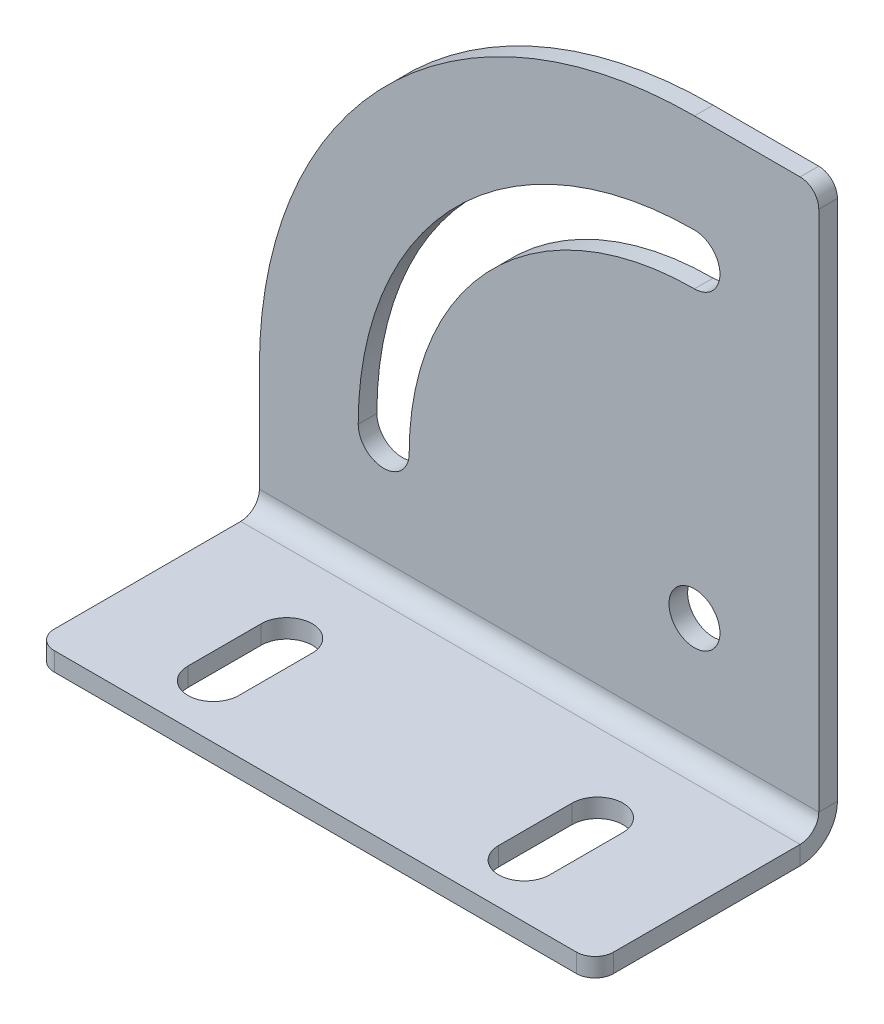
ISO-10303-21;
HEADER;
FILE_DESCRIPTION(('STEP AP214'),'2;1');
FILE_NAME('part.step','',(''),(''),'','','');
FILE_SCHEMA(('AUTOMOTIVE_DESIGN { 1 0 10303 214 1 1 1 1 }'));
ENDSEC;
DATA;
#1=APPLICATION_CONTEXT('core data for automotive mechanical design processes');
#2=APPLICATION_PROTOCOL_DEFINITION('international standard','automotive_design',2000,#1);
#3=PRODUCT_CONTEXT('',#1,'mechanical');
#4=PRODUCT('Part','Part','',(#3));
#5=PRODUCT_RELATED_PRODUCT_CATEGORY('part','',(#4));
#6=PRODUCT_DEFINITION_FORMATION('','',#4);
#7=PRODUCT_DEFINITION_CONTEXT('part definition',#1,'design');
#8=PRODUCT_DEFINITION('design','',#6,#7);
#9=PRODUCT_DEFINITION_SHAPE('','',#8);
#10=(LENGTH_UNIT() NAMED_UNIT(*) SI_UNIT(.MILLI.,.METRE.));
#11=(NAMED_UNIT(*) PLANE_ANGLE_UNIT() SI_UNIT($,.RADIAN.));
#12=(NAMED_UNIT(*) SI_UNIT($,.STERADIAN.) SOLID_ANGLE_UNIT());
#13=UNCERTAINTY_MEASURE_WITH_UNIT(LENGTH_MEASURE(1.E-05),#10,'distance_accuracy_value','');
#14=(GEOMETRIC_REPRESENTATION_CONTEXT(3) GLOBAL_UNCERTAINTY_ASSIGNED_CONTEXT((#13)) GLOBAL_UNIT_ASSIGNED_CONTEXT((#10,
#11,#12)) REPRESENTATION_CONTEXT('',''));
#15=CARTESIAN_POINT('',(0.,0.,0.));
#16=DIRECTION('',(0.,0.,1.));
#17=DIRECTION('',(1.,0.,0.));
#18=AXIS2_PLACEMENT_3D('',#15,#16,#17);
#19=CARTESIAN_POINT('',(-50.,0.,3.));
#20=DIRECTION('',(0.,0.,-1.));
#21=DIRECTION('',(-1.,0.,0.));
#22=AXIS2_PLACEMENT_3D('',#19,#20,#21);
#23=CYLINDRICAL_SURFACE('',#22,4.1);
#24=DIRECTION('',(0.,0.,1.));
#25=VECTOR('',#24,1.);
#26=CARTESIAN_POINT('',(-45.9,0.,3.));
#27=LINE('',#26,#25);
#28=CARTESIAN_POINT('',(-45.9,0.,0.));
#29=VERTEX_POINT('',#28);
#30=CARTESIAN_POINT('',(-45.9,0.,3.));
#31=VERTEX_POINT('',#30);
#32=EDGE_CURVE('E376',#29,#31,#27,.T.);
#33=ORIENTED_EDGE('',*,*,#32,.F.);
#34=CARTESIAN_POINT('',(-50.,0.,0.));
#35=DIRECTION('',(0.,0.,1.));
#36=DIRECTION('',(1.,0.,0.));
#37=AXIS2_PLACEMENT_3D('',#34,#35,#36);
#38=CIRCLE('',#37,4.1);
#39=CARTESIAN_POINT('',(-54.1,0.,0.));
#40=VERTEX_POINT('',#39);
#41=EDGE_CURVE('E333',#40,#29,#38,.T.);
#42=ORIENTED_EDGE('',*,*,#41,.F.);
#43=DIRECTION('',(0.,0.,1.));
#44=VECTOR('',#43,1.);
#45=CARTESIAN_POINT('',(-54.1,0.,3.));
#46=LINE('',#45,#44);
#47=CARTESIAN_POINT('',(-54.1,0.,3.));
#48=VERTEX_POINT('',#47);
#49=EDGE_CURVE('E374',#40,#48,#46,.T.);
#50=ORIENTED_EDGE('',*,*,#49,.T.);
#51=CARTESIAN_POINT('',(-50.,0.,3.));
#52=DIRECTION('',(0.,0.,1.));
#53=DIRECTION('',(1.,0.,0.));
#54=AXIS2_PLACEMENT_3D('',#51,#52,#53);
#55=CIRCLE('',#54,4.1);
#56=EDGE_CURVE('E203',#48,#31,#55,.T.);
#57=ORIENTED_EDGE('',*,*,#56,.T.);
#58=EDGE_LOOP('',(#33,#42,#50,#57));
#59=FACE_BOUND('',#58,.T.);
#60=ADVANCED_FACE('F16',(#59),#23,.F.);
#61=CARTESIAN_POINT('',(0.,0.,3.));
#62=DIRECTION('',(0.,0.,-1.));
#63=DIRECTION('',(-1.,0.,0.));
#64=AXIS2_PLACEMENT_3D('',#61,#62,#63);
#65=CYLINDRICAL_SURFACE('',#64,54.1);
#66=ORIENTED_EDGE('',*,*,#49,.F.);
#67=CARTESIAN_POINT('',(0.,0.,0.));
#68=DIRECTION('',(0.,0.,1.));
#69=DIRECTION('',(1.,0.,0.));
#70=AXIS2_PLACEMENT_3D('',#67,#68,#69);
#71=CIRCLE('',#70,54.1);
#72=CARTESIAN_POINT('',(0.,54.1,0.));
#73=VERTEX_POINT('',#72);
#74=EDGE_CURVE('E330',#73,#40,#71,.T.);
#75=ORIENTED_EDGE('',*,*,#74,.F.);
#76=DIRECTION('',(0.,0.,1.));
#77=VECTOR('',#76,1.);
#78=CARTESIAN_POINT('',(0.,54.1,3.));
#79=LINE('',#78,#77);
#80=CARTESIAN_POINT('',(0.,54.1,3.));
#81=VERTEX_POINT('',#80);
#82=EDGE_CURVE('E372',#73,#81,#79,.T.);
#83=ORIENTED_EDGE('',*,*,#82,.T.);
#84=CARTESIAN_POINT('',(0.,0.,3.));
#85=DIRECTION('',(0.,0.,1.));
#86=DIRECTION('',(1.,0.,0.));
#87=AXIS2_PLACEMENT_3D('',#84,#85,#86);
#88=CIRCLE('',#87,54.1);
#89=EDGE_CURVE('E206',#81,#48,#88,.T.);
#90=ORIENTED_EDGE('',*,*,#89,.T.);
#91=EDGE_LOOP('',(#66,#75,#83,#90));
#92=FACE_BOUND('',#91,.T.);
#93=ADVANCED_FACE('F432',(#92),#65,.F.);
#94=CARTESIAN_POINT('',(0.,50.,3.));
#95=DIRECTION('',(0.,0.,-1.));
#96=DIRECTION('',(-1.,0.,0.));
#97=AXIS2_PLACEMENT_3D('',#94,#95,#96);
#98=CYLINDRICAL_SURFACE('',#97,4.1);
#99=ORIENTED_EDGE('',*,*,#82,.F.);
#100=CARTESIAN_POINT('',(0.,50.,0.));
#101=DIRECTION('',(0.,0.,1.));
#102=DIRECTION('',(1.,0.,0.));
#103=AXIS2_PLACEMENT_3D('',#100,#101,#102);
#104=CIRCLE('',#103,4.1);
#105=CARTESIAN_POINT('',(0.,45.9,0.));
#106=VERTEX_POINT('',#105);
#107=EDGE_CURVE('E321',#106,#73,#104,.T.);
#108=ORIENTED_EDGE('',*,*,#107,.F.);
#109=DIRECTION('',(0.,0.,1.));
#110=VECTOR('',#109,1.);
#111=CARTESIAN_POINT('',(0.,45.9,3.));
#112=LINE('',#111,#110);
#113=CARTESIAN_POINT('',(0.,45.9,3.));
#114=VERTEX_POINT('',#113);
#115=EDGE_CURVE('E370',#106,#114,#112,.T.);
#116=ORIENTED_EDGE('',*,*,#115,.T.);
#117=CARTESIAN_POINT('',(0.,50.,3.));
#118=DIRECTION('',(0.,0.,1.));
#119=DIRECTION('',(1.,0.,0.));
#120=AXIS2_PLACEMENT_3D('',#117,#118,#119);
#121=CIRCLE('',#120,4.1);
#122=EDGE_CURVE('E194',#114,#81,#121,.T.);
#123=ORIENTED_EDGE('',*,*,#122,.T.);
#124=EDGE_LOOP('',(#99,#108,#116,#123));
#125=FACE_BOUND('',#124,.T.);
#126=ADVANCED_FACE('F438',(#125),#98,.F.);
#127=CARTESIAN_POINT('',(20.,-20.,3.));
#128=DIRECTION('',(-1.,0.,0.));
#129=DIRECTION('',(0.,1.,0.));
#130=AXIS2_PLACEMENT_3D('',#127,#128,#129);
#131=PLANE('',#130);
#132=DIRECTION('',(0.,1.,0.));
#133=VECTOR('',#132,1.);
#134=CARTESIAN_POINT('',(20.,0.,0.));
#135=LINE('',#134,#133);
#136=CARTESIAN_POINT('',(20.,-17.,0.));
#137=VERTEX_POINT('',#136);
#138=CARTESIAN_POINT('',(20.,67.,0.));
#139=VERTEX_POINT('',#138);
#140=EDGE_CURVE('E318',#137,#139,#135,.T.);
#141=ORIENTED_EDGE('',*,*,#140,.T.);
#142=DIRECTION('',(0.,0.,-1.));
#143=VECTOR('',#142,1.);
#144=CARTESIAN_POINT('',(20.,67.,3.));
#145=LINE('',#144,#143);
#146=CARTESIAN_POINT('',(20.,66.9999999999999,3.));
#147=VERTEX_POINT('',#146);
#148=EDGE_CURVE('E378',#139,#147,#145,.F.);
#149=ORIENTED_EDGE('',*,*,#148,.T.);
#150=DIRECTION('',(0.,1.,0.));
#151=VECTOR('',#150,1.);
#152=CARTESIAN_POINT('',(20.,-20.,3.));
#153=LINE('',#152,#151);
#154=CARTESIAN_POINT('',(20.,-17.,3.));
#155=VERTEX_POINT('',#154);
#156=EDGE_CURVE('E181',#155,#147,#153,.T.);
#157=ORIENTED_EDGE('',*,*,#156,.F.);
#158=DIRECTION('',(0.,0.,1.));
#159=VECTOR('',#158,1.);
#160=CARTESIAN_POINT('',(20.,-17.,3.));
#161=LINE('',#160,#159);
#162=EDGE_CURVE('E190',#137,#155,#161,.T.);
#163=ORIENTED_EDGE('',*,*,#162,.F.);
#164=EDGE_LOOP('',(#141,#149,#157,#163));
#165=FACE_BOUND('',#164,.T.);
#166=ADVANCED_FACE('F385',(#165),#131,.F.);
#167=CARTESIAN_POINT('',(20.,70.,3.));
#168=DIRECTION('',(0.,-1.,0.));
#169=DIRECTION('',(-1.,0.,0.));
#170=AXIS2_PLACEMENT_3D('',#167,#168,#169);
#171=PLANE('',#170);
#172=DIRECTION('',(-1.,0.,0.));
#173=VECTOR('',#172,1.);
#174=CARTESIAN_POINT('',(20.,70.,3.));
#175=LINE('',#174,#173);
#176=CARTESIAN_POINT('',(17.,70.,3.));
#177=VERTEX_POINT('',#176);
#178=CARTESIAN_POINT('',(0.,70.,3.));
#179=VERTEX_POINT('',#178);
#180=EDGE_CURVE('E173',#177,#179,#175,.T.);
#181=ORIENTED_EDGE('',*,*,#180,.F.);
#182=DIRECTION('',(0.,0.,-1.));
#183=VECTOR('',#182,1.);
#184=CARTESIAN_POINT('',(17.,70.,3.));
#185=LINE('',#184,#183);
#186=CARTESIAN_POINT('',(17.,70.,0.));
#187=VERTEX_POINT('',#186);
#188=EDGE_CURVE('E24',#177,#187,#185,.T.);
#189=ORIENTED_EDGE('',*,*,#188,.T.);
#190=DIRECTION('',(-1.,0.,0.));
#191=VECTOR('',#190,1.);
#192=CARTESIAN_POINT('',(0.,70.,0.));
#193=LINE('',#192,#191);
#194=CARTESIAN_POINT('',(0.,70.,0.));
#195=VERTEX_POINT('',#194);
#196=EDGE_CURVE('E186',#187,#195,#193,.T.);
#197=ORIENTED_EDGE('',*,*,#196,.T.);
#198=DIRECTION('',(0.,0.,1.));
#199=VECTOR('',#198,1.);
#200=CARTESIAN_POINT('',(0.,70.,3.));
#201=LINE('',#200,#199);
#202=EDGE_CURVE('E184',#195,#179,#201,.T.);
#203=ORIENTED_EDGE('',*,*,#202,.T.);
#204=EDGE_LOOP('',(#181,#189,#197,#203));
#205=FACE_BOUND('',#204,.T.);
#206=ADVANCED_FACE('F185',(#205),#171,.F.);
#207=CARTESIAN_POINT('',(0.,0.,3.));
#208=DIRECTION('',(0.,0.,-1.));
#209=DIRECTION('',(-1.,0.,0.));
#210=AXIS2_PLACEMENT_3D('',#207,#208,#209);
#211=CYLINDRICAL_SURFACE('',#210,70.);
#212=ORIENTED_EDGE('',*,*,#202,.F.);
#213=CARTESIAN_POINT('',(0.,0.,0.));
#214=DIRECTION('',(0.,0.,1.));
#215=DIRECTION('',(1.,0.,0.));
#216=AXIS2_PLACEMENT_3D('',#213,#214,#215);
#217=CIRCLE('',#216,70.);
#218=CARTESIAN_POINT('',(-70.,0.,0.));
#219=VERTEX_POINT('',#218);
#220=EDGE_CURVE('E319',#195,#219,#217,.T.);
#221=ORIENTED_EDGE('',*,*,#220,.T.);
#222=DIRECTION('',(0.,0.,1.));
#223=VECTOR('',#222,1.);
#224=CARTESIAN_POINT('',(-70.,0.,3.));
#225=LINE('',#224,#223);
#226=CARTESIAN_POINT('',(-70.,0.,3.));
#227=VERTEX_POINT('',#226);
#228=EDGE_CURVE('E191',#219,#227,#225,.T.);
#229=ORIENTED_EDGE('',*,*,#228,.T.);
#230=CARTESIAN_POINT('',(0.,0.,3.));
#231=DIRECTION('',(0.,0.,1.));
#232=DIRECTION('',(-1.,0.,0.));
#233=AXIS2_PLACEMENT_3D('',#230,#231,#232);
#234=CIRCLE('',#233,70.);
#235=EDGE_CURVE('E179',#179,#227,#234,.T.);
#236=ORIENTED_EDGE('',*,*,#235,.F.);
#237=EDGE_LOOP('',(#212,#221,#229,#236));
#238=FACE_BOUND('',#237,.T.);
#239=ADVANCED_FACE('F193',(#238),#211,.T.);
#240=CARTESIAN_POINT('',(-70.,-20.,3.));
#241=DIRECTION('',(1.,0.,0.));
#242=DIRECTION('',(0.,-1.,0.));
#243=AXIS2_PLACEMENT_3D('',#240,#241,#242);
#244=PLANE('',#243);
#245=ORIENTED_EDGE('',*,*,#228,.F.);
#246=DIRECTION('',(0.,1.,0.));
#247=VECTOR('',#246,1.);
#248=CARTESIAN_POINT('',(-70.,0.,0.));
#249=LINE('',#248,#247);
#250=CARTESIAN_POINT('',(-70.,-17.,0.));
#251=VERTEX_POINT('',#250);
#252=EDGE_CURVE('E314',#219,#251,#249,.F.);
#253=ORIENTED_EDGE('',*,*,#252,.T.);
#254=DIRECTION('',(0.,0.,1.));
#255=VECTOR('',#254,1.);
#256=CARTESIAN_POINT('',(-70.,-17.,3.));
#257=LINE('',#256,#255);
#258=CARTESIAN_POINT('',(-70.,-17.,3.));
#259=VERTEX_POINT('',#258);
#260=EDGE_CURVE('E366',#251,#259,#257,.T.);
#261=ORIENTED_EDGE('',*,*,#260,.T.);
#262=DIRECTION('',(0.,-1.,0.));
#263=VECTOR('',#262,1.);
#264=CARTESIAN_POINT('',(-70.,-20.,3.));
#265=LINE('',#264,#263);
#266=EDGE_CURVE('E265',#227,#259,#265,.T.);
#267=ORIENTED_EDGE('',*,*,#266,.F.);
#268=EDGE_LOOP('',(#245,#253,#261,#267));
#269=FACE_BOUND('',#268,.T.);
#270=ADVANCED_FACE('F516',(#269),#244,.F.);
#271=CARTESIAN_POINT('',(-70.,-17.,6.));
#272=DIRECTION('',(1.,0.,0.));
#273=DIRECTION('',(0.,0.,-1.));
#274=AXIS2_PLACEMENT_3D('',#271,#272,#273);
#275=PLANE('',#274);
#276=ORIENTED_EDGE('',*,*,#260,.F.);
#277=CARTESIAN_POINT('',(-70.,-17.,6.));
#278=DIRECTION('',(1.,0.,0.));
#279=DIRECTION('',(0.,1.,0.));
#280=AXIS2_PLACEMENT_3D('',#277,#278,#279);
#281=CIRCLE('',#280,6.);
#282=CARTESIAN_POINT('',(-70.,-23.,6.));
#283=VERTEX_POINT('',#282);
#284=EDGE_CURVE('E311',#251,#283,#281,.F.);
#285=ORIENTED_EDGE('',*,*,#284,.T.);
#286=DIRECTION('',(0.,1.,0.));
#287=VECTOR('',#286,1.);
#288=CARTESIAN_POINT('',(-70.,-20.,6.));
#289=LINE('',#288,#287);
#290=CARTESIAN_POINT('',(-70.,-20.,6.));
#291=VERTEX_POINT('',#290);
#292=EDGE_CURVE('E364',#283,#291,#289,.T.);
#293=ORIENTED_EDGE('',*,*,#292,.T.);
#294=CARTESIAN_POINT('',(-70.,-17.,6.));
#295=DIRECTION('',(-1.,0.,0.));
#296=DIRECTION('',(0.,0.,1.));
#297=AXIS2_PLACEMENT_3D('',#294,#295,#296);
#298=CIRCLE('',#297,3.);
#299=EDGE_CURVE('E261',#259,#291,#298,.T.);
#300=ORIENTED_EDGE('',*,*,#299,.F.);
#301=EDGE_LOOP('',(#276,#285,#293,#300));
#302=FACE_BOUND('',#301,.T.);
#303=ADVANCED_FACE('F394',(#302),#275,.F.);
#304=CARTESIAN_POINT('',(-70.,-20.,39.));
#305=DIRECTION('',(1.,0.,0.));
#306=DIRECTION('',(0.,0.,-1.));
#307=AXIS2_PLACEMENT_3D('',#304,#305,#306);
#308=PLANE('',#307);
#309=ORIENTED_EDGE('',*,*,#292,.F.);
#310=DIRECTION('',(0.,0.,1.));
#311=VECTOR('',#310,1.);
#312=CARTESIAN_POINT('',(-70.,-23.,39.));
#313=LINE('',#312,#311);
#314=CARTESIAN_POINT('',(-70.,-23.,36.));
#315=VERTEX_POINT('',#314);
#316=EDGE_CURVE('E292',#315,#283,#313,.F.);
#317=ORIENTED_EDGE('',*,*,#316,.F.);
#318=DIRECTION('',(0.,1.,0.));
#319=VECTOR('',#318,1.);
#320=CARTESIAN_POINT('',(-70.,-20.,36.));
#321=LINE('',#320,#319);
#322=CARTESIAN_POINT('',(-70.,-20.,36.));
#323=VERTEX_POINT('',#322);
#324=EDGE_CURVE('E362',#315,#323,#321,.T.);
#325=ORIENTED_EDGE('',*,*,#324,.T.);
#326=DIRECTION('',(0.,0.,-1.));
#327=VECTOR('',#326,1.);
#328=CARTESIAN_POINT('',(-70.,-20.,39.));
#329=LINE('',#328,#327);
#330=EDGE_CURVE('E236',#323,#291,#329,.T.);
#331=ORIENTED_EDGE('',*,*,#330,.T.);
#332=EDGE_LOOP('',(#309,#317,#325,#331));
#333=FACE_BOUND('',#332,.T.);
#334=ADVANCED_FACE('F509',(#333),#308,.F.);
#335=CARTESIAN_POINT('',(-67.,-20.,36.));
#336=DIRECTION('',(0.,1.,0.));
#337=DIRECTION('',(-1.,0.,0.));
#338=AXIS2_PLACEMENT_3D('',#335,#336,#337);
#339=CYLINDRICAL_SURFACE('',#338,3.);
#340=ORIENTED_EDGE('',*,*,#324,.F.);
#341=CARTESIAN_POINT('',(-67.,-23.,36.));
#342=DIRECTION('',(0.,1.,0.));
#343=DIRECTION('',(-1.,0.,0.));
#344=AXIS2_PLACEMENT_3D('',#341,#342,#343);
#345=CIRCLE('',#344,3.);
#346=CARTESIAN_POINT('',(-67.,-23.,39.));
#347=VERTEX_POINT('',#346);
#348=EDGE_CURVE('E306',#315,#347,#345,.T.);
#349=ORIENTED_EDGE('',*,*,#348,.T.);
#350=DIRECTION('',(0.,1.,0.));
#351=VECTOR('',#350,1.);
#352=CARTESIAN_POINT('',(-67.,-20.,39.));
#353=LINE('',#352,#351);
#354=CARTESIAN_POINT('',(-67.,-20.,39.));
#355=VERTEX_POINT('',#354);
#356=EDGE_CURVE('E360',#347,#355,#353,.T.);
#357=ORIENTED_EDGE('',*,*,#356,.T.);
#358=CARTESIAN_POINT('',(-67.,-20.,36.));
#359=DIRECTION('',(0.,1.,0.));
#360=DIRECTION('',(-1.,0.,0.));
#361=AXIS2_PLACEMENT_3D('',#358,#359,#360);
#362=CIRCLE('',#361,3.);
#363=EDGE_CURVE('E239',#323,#355,#362,.T.);
#364=ORIENTED_EDGE('',*,*,#363,.F.);
#365=EDGE_LOOP('',(#340,#349,#357,#364));
#366=FACE_BOUND('',#365,.T.);
#367=ADVANCED_FACE('F505',(#366),#339,.T.);
#368=CARTESIAN_POINT('',(0.,-20.,39.));
#369=DIRECTION('',(0.,0.,1.));
#370=DIRECTION('',(1.,0.,0.));
#371=AXIS2_PLACEMENT_3D('',#368,#369,#370);
#372=PLANE('',#371);
#373=ORIENTED_EDGE('',*,*,#356,.F.);
#374=DIRECTION('',(-1.,0.,0.));
#375=VECTOR('',#374,1.);
#376=CARTESIAN_POINT('',(0.,-23.,39.));
#377=LINE('',#376,#375);
#378=CARTESIAN_POINT('',(17.,-23.,39.));
#379=VERTEX_POINT('',#378);
#380=EDGE_CURVE('E303',#347,#379,#377,.F.);
#381=ORIENTED_EDGE('',*,*,#380,.T.);
#382=DIRECTION('',(0.,1.,0.));
#383=VECTOR('',#382,1.);
#384=CARTESIAN_POINT('',(17.,-20.,39.));
#385=LINE('',#384,#383);
#386=CARTESIAN_POINT('',(17.,-20.,39.));
#387=VERTEX_POINT('',#386);
#388=EDGE_CURVE('E358',#379,#387,#385,.T.);
#389=ORIENTED_EDGE('',*,*,#388,.T.);
#390=DIRECTION('',(1.,0.,0.));
#391=VECTOR('',#390,1.);
#392=CARTESIAN_POINT('',(0.,-20.,39.));
#393=LINE('',#392,#391);
#394=EDGE_CURVE('E242',#355,#387,#393,.T.);
#395=ORIENTED_EDGE('',*,*,#394,.F.);
#396=EDGE_LOOP('',(#373,#381,#389,#395));
#397=FACE_BOUND('',#396,.T.);
#398=ADVANCED_FACE('F501',(#397),#372,.T.);
#399=CARTESIAN_POINT('',(17.,-20.,36.));
#400=DIRECTION('',(0.,1.,0.));
#401=DIRECTION('',(-1.,0.,0.));
#402=AXIS2_PLACEMENT_3D('',#399,#400,#401);
#403=CYLINDRICAL_SURFACE('',#402,3.);
#404=ORIENTED_EDGE('',*,*,#388,.F.);
#405=CARTESIAN_POINT('',(17.,-23.,36.));
#406=DIRECTION('',(0.,1.,0.));
#407=DIRECTION('',(-1.,0.,0.));
#408=AXIS2_PLACEMENT_3D('',#405,#406,#407);
#409=CIRCLE('',#408,3.);
#410=CARTESIAN_POINT('',(20.,-23.,36.));
#411=VERTEX_POINT('',#410);
#412=EDGE_CURVE('E300',#379,#411,#409,.T.);
#413=ORIENTED_EDGE('',*,*,#412,.T.);
#414=DIRECTION('',(0.,1.,0.));
#415=VECTOR('',#414,1.);
#416=CARTESIAN_POINT('',(20.,-20.,36.));
#417=LINE('',#416,#415);
#418=CARTESIAN_POINT('',(20.,-20.,36.));
#419=VERTEX_POINT('',#418);
#420=EDGE_CURVE('E356',#411,#419,#417,.T.);
#421=ORIENTED_EDGE('',*,*,#420,.T.);
#422=CARTESIAN_POINT('',(17.,-20.,36.));
#423=DIRECTION('',(0.,1.,0.));
#424=DIRECTION('',(-1.,0.,0.));
#425=AXIS2_PLACEMENT_3D('',#422,#423,#424);
#426=CIRCLE('',#425,3.);
#427=EDGE_CURVE('E245',#387,#419,#426,.T.);
#428=ORIENTED_EDGE('',*,*,#427,.F.);
#429=EDGE_LOOP('',(#404,#413,#421,#428));
#430=FACE_BOUND('',#429,.T.);
#431=ADVANCED_FACE('F498',(#430),#403,.T.);
#432=CARTESIAN_POINT('',(20.,-20.,39.));
#433=DIRECTION('',(1.,0.,0.));
#434=DIRECTION('',(0.,0.,-1.));
#435=AXIS2_PLACEMENT_3D('',#432,#433,#434);
#436=PLANE('',#435);
#437=ORIENTED_EDGE('',*,*,#420,.F.);
#438=DIRECTION('',(0.,0.,1.));
#439=VECTOR('',#438,1.);
#440=CARTESIAN_POINT('',(20.,-23.,39.));
#441=LINE('',#440,#439);
#442=CARTESIAN_POINT('',(20.,-23.,6.));
#443=VERTEX_POINT('',#442);
#444=EDGE_CURVE('E271',#411,#443,#441,.F.);
#445=ORIENTED_EDGE('',*,*,#444,.T.);
#446=DIRECTION('',(0.,1.,0.));
#447=VECTOR('',#446,1.);
#448=CARTESIAN_POINT('',(20.,-20.,6.));
#449=LINE('',#448,#447);
#450=CARTESIAN_POINT('',(20.,-20.,6.));
#451=VERTEX_POINT('',#450);
#452=EDGE_CURVE('E354',#443,#451,#449,.T.);
#453=ORIENTED_EDGE('',*,*,#452,.T.);
#454=DIRECTION('',(0.,0.,-1.));
#455=VECTOR('',#454,1.);
#456=CARTESIAN_POINT('',(20.,-20.,39.));
#457=LINE('',#456,#455);
#458=EDGE_CURVE('E248',#419,#451,#457,.T.);
#459=ORIENTED_EDGE('',*,*,#458,.F.);
#460=EDGE_LOOP('',(#437,#445,#453,#459));
#461=FACE_BOUND('',#460,.T.);
#462=ADVANCED_FACE('F409',(#461),#436,.T.);
#463=CARTESIAN_POINT('',(0.,-20.,30.4));
#464=DIRECTION('',(0.,1.,0.));
#465=DIRECTION('',(-1.,0.,0.));
#466=AXIS2_PLACEMENT_3D('',#463,#464,#465);
#467=CYLINDRICAL_SURFACE('',#466,4.1);
#468=DIRECTION('',(0.,1.,0.));
#469=VECTOR('',#468,1.);
#470=CARTESIAN_POINT('',(4.1,-20.,30.4));
#471=LINE('',#470,#469);
#472=CARTESIAN_POINT('',(4.1,-23.,30.4));
#473=VERTEX_POINT('',#472);
#474=CARTESIAN_POINT('',(4.1,-20.,30.4));
#475=VERTEX_POINT('',#474);
#476=EDGE_CURVE('E352',#473,#475,#471,.T.);
#477=ORIENTED_EDGE('',*,*,#476,.F.);
#478=CARTESIAN_POINT('',(0.,-23.,30.4));
#479=DIRECTION('',(0.,1.,0.));
#480=DIRECTION('',(0.,0.,1.));
#481=AXIS2_PLACEMENT_3D('',#478,#479,#480);
#482=CIRCLE('',#481,4.1);
#483=CARTESIAN_POINT('',(-4.1,-23.,30.4));
#484=VERTEX_POINT('',#483);
#485=EDGE_CURVE('E293',#484,#473,#482,.T.);
#486=ORIENTED_EDGE('',*,*,#485,.F.);
#487=DIRECTION('',(0.,1.,0.));
#488=VECTOR('',#487,1.);
#489=CARTESIAN_POINT('',(-4.1,-20.,30.4));
#490=LINE('',#489,#488);
#491=CARTESIAN_POINT('',(-4.1,-20.,30.4));
#492=VERTEX_POINT('',#491);
#493=EDGE_CURVE('E350',#484,#492,#490,.T.);
#494=ORIENTED_EDGE('',*,*,#493,.T.);
#495=CARTESIAN_POINT('',(0.,-20.,30.4));
#496=DIRECTION('',(0.,1.,0.));
#497=DIRECTION('',(0.,0.,1.));
#498=AXIS2_PLACEMENT_3D('',#495,#496,#497);
#499=CIRCLE('',#498,4.1);
#500=EDGE_CURVE('E230',#492,#475,#499,.T.);
#501=ORIENTED_EDGE('',*,*,#500,.T.);
#502=EDGE_LOOP('',(#477,#486,#494,#501));
#503=FACE_BOUND('',#502,.T.);
#504=ADVANCED_FACE('F488',(#503),#467,.F.);
#505=CARTESIAN_POINT('',(-4.1,-20.,18.6));
#506=DIRECTION('',(-1.,0.,0.));
#507=DIRECTION('',(0.,0.,1.));
#508=AXIS2_PLACEMENT_3D('',#505,#506,#507);
#509=PLANE('',#508);
#510=ORIENTED_EDGE('',*,*,#493,.F.);
#511=DIRECTION('',(0.,0.,1.));
#512=VECTOR('',#511,1.);
#513=CARTESIAN_POINT('',(-4.1,-23.,39.));
#514=LINE('',#513,#512);
#515=CARTESIAN_POINT('',(-4.1,-23.,18.6));
#516=VERTEX_POINT('',#515);
#517=EDGE_CURVE('E289',#516,#484,#514,.T.);
#518=ORIENTED_EDGE('',*,*,#517,.F.);
#519=DIRECTION('',(0.,1.,0.));
#520=VECTOR('',#519,1.);
#521=CARTESIAN_POINT('',(-4.1,-20.,18.6));
#522=LINE('',#521,#520);
#523=CARTESIAN_POINT('',(-4.1,-20.,18.6));
#524=VERTEX_POINT('',#523);
#525=EDGE_CURVE('E348',#516,#524,#522,.T.);
#526=ORIENTED_EDGE('',*,*,#525,.T.);
#527=DIRECTION('',(0.,0.,1.));
#528=VECTOR('',#527,1.);
#529=CARTESIAN_POINT('',(-4.1,-20.,18.6));
#530=LINE('',#529,#528);
#531=EDGE_CURVE('E233',#524,#492,#530,.T.);
#532=ORIENTED_EDGE('',*,*,#531,.T.);
#533=EDGE_LOOP('',(#510,#518,#526,#532));
#534=FACE_BOUND('',#533,.T.);
#535=ADVANCED_FACE('F484',(#534),#509,.F.);
#536=CARTESIAN_POINT('',(0.,-20.,18.6));
#537=DIRECTION('',(0.,1.,0.));
#538=DIRECTION('',(-1.,0.,0.));
#539=AXIS2_PLACEMENT_3D('',#536,#537,#538);
#540=CYLINDRICAL_SURFACE('',#539,4.1);
#541=ORIENTED_EDGE('',*,*,#525,.F.);
#542=CARTESIAN_POINT('',(0.,-23.,18.6));
#543=DIRECTION('',(0.,1.,0.));
#544=DIRECTION('',(0.,0.,1.));
#545=AXIS2_PLACEMENT_3D('',#542,#543,#544);
#546=CIRCLE('',#545,4.1);
#547=CARTESIAN_POINT('',(4.1,-23.,18.6));
#548=VERTEX_POINT('',#547);
#549=EDGE_CURVE('E280',#548,#516,#546,.T.);
#550=ORIENTED_EDGE('',*,*,#549,.F.);
#551=DIRECTION('',(0.,1.,0.));
#552=VECTOR('',#551,1.);
#553=CARTESIAN_POINT('',(4.1,-20.,18.6));
#554=LINE('',#553,#552);
#555=CARTESIAN_POINT('',(4.1,-20.,18.6));
#556=VERTEX_POINT('',#555);
#557=EDGE_CURVE('E346',#548,#556,#554,.T.);
#558=ORIENTED_EDGE('',*,*,#557,.T.);
#559=CARTESIAN_POINT('',(0.,-20.,18.6));
#560=DIRECTION('',(0.,1.,0.));
#561=DIRECTION('',(0.,0.,1.));
#562=AXIS2_PLACEMENT_3D('',#559,#560,#561);
#563=CIRCLE('',#562,4.1);
#564=EDGE_CURVE('E224',#556,#524,#563,.T.);
#565=ORIENTED_EDGE('',*,*,#564,.T.);
#566=EDGE_LOOP('',(#541,#550,#558,#565));
#567=FACE_BOUND('',#566,.T.);
#568=ADVANCED_FACE('F479',(#567),#540,.F.);
#569=CARTESIAN_POINT('',(-50.,-20.,30.4));
#570=DIRECTION('',(0.,1.,0.));
#571=DIRECTION('',(-1.,0.,0.));
#572=AXIS2_PLACEMENT_3D('',#569,#570,#571);
#573=CYLINDRICAL_SURFACE('',#572,4.09999999999999);
#574=DIRECTION('',(0.,1.,0.));
#575=VECTOR('',#574,1.);
#576=CARTESIAN_POINT('',(-45.9,-20.,30.4));
#577=LINE('',#576,#575);
#578=CARTESIAN_POINT('',(-45.9,-23.,30.4));
#579=VERTEX_POINT('',#578);
#580=CARTESIAN_POINT('',(-45.9,-20.,30.4));
#581=VERTEX_POINT('',#580);
#582=EDGE_CURVE('E344',#579,#581,#577,.T.);
#583=ORIENTED_EDGE('',*,*,#582,.F.);
#584=CARTESIAN_POINT('',(-50.,-23.,30.4));
#585=DIRECTION('',(0.,1.,0.));
#586=DIRECTION('',(0.,0.,1.));
#587=AXIS2_PLACEMENT_3D('',#584,#585,#586);
#588=CIRCLE('',#587,4.09999999999999);
#589=CARTESIAN_POINT('',(-54.1,-23.,30.4));
#590=VERTEX_POINT('',#589);
#591=EDGE_CURVE('E281',#590,#579,#588,.T.);
#592=ORIENTED_EDGE('',*,*,#591,.F.);
#593=DIRECTION('',(0.,1.,0.));
#594=VECTOR('',#593,1.);
#595=CARTESIAN_POINT('',(-54.1,-20.,30.4));
#596=LINE('',#595,#594);
#597=CARTESIAN_POINT('',(-54.1,-20.,30.4));
#598=VERTEX_POINT('',#597);
#599=EDGE_CURVE('E342',#590,#598,#596,.T.);
#600=ORIENTED_EDGE('',*,*,#599,.T.);
#601=CARTESIAN_POINT('',(-50.,-20.,30.4));
#602=DIRECTION('',(0.,1.,0.));
#603=DIRECTION('',(0.,0.,1.));
#604=AXIS2_PLACEMENT_3D('',#601,#602,#603);
#605=CIRCLE('',#604,4.09999999999999);
#606=EDGE_CURVE('E218',#598,#581,#605,.T.);
#607=ORIENTED_EDGE('',*,*,#606,.T.);
#608=EDGE_LOOP('',(#583,#592,#600,#607));
#609=FACE_BOUND('',#608,.T.);
#610=ADVANCED_FACE('F476',(#609),#573,.F.);
#611=CARTESIAN_POINT('',(-54.1,-20.,18.6));
#612=DIRECTION('',(-1.,0.,0.));
#613=DIRECTION('',(0.,0.,1.));
#614=AXIS2_PLACEMENT_3D('',#611,#612,#613);
#615=PLANE('',#614);
#616=ORIENTED_EDGE('',*,*,#599,.F.);
#617=DIRECTION('',(0.,0.,1.));
#618=VECTOR('',#617,1.);
#619=CARTESIAN_POINT('',(-54.1,-23.,39.));
#620=LINE('',#619,#618);
#621=CARTESIAN_POINT('',(-54.1,-23.,18.6));
#622=VERTEX_POINT('',#621);
#623=EDGE_CURVE('E277',#622,#590,#620,.T.);
#624=ORIENTED_EDGE('',*,*,#623,.F.);
#625=DIRECTION('',(0.,1.,0.));
#626=VECTOR('',#625,1.);
#627=CARTESIAN_POINT('',(-54.1,-20.,18.6));
#628=LINE('',#627,#626);
#629=CARTESIAN_POINT('',(-54.1,-20.,18.6));
#630=VERTEX_POINT('',#629);
#631=EDGE_CURVE('E340',#622,#630,#628,.T.);
#632=ORIENTED_EDGE('',*,*,#631,.T.);
#633=DIRECTION('',(0.,0.,1.));
#634=VECTOR('',#633,1.);
#635=CARTESIAN_POINT('',(-54.1,-20.,18.6));
#636=LINE('',#635,#634);
#637=EDGE_CURVE('E221',#630,#598,#636,.T.);
#638=ORIENTED_EDGE('',*,*,#637,.T.);
#639=EDGE_LOOP('',(#616,#624,#632,#638));
#640=FACE_BOUND('',#639,.T.);
#641=ADVANCED_FACE('F472',(#640),#615,.F.);
#642=CARTESIAN_POINT('',(-50.,-20.,18.6));
#643=DIRECTION('',(0.,1.,0.));
#644=DIRECTION('',(-1.,0.,0.));
#645=AXIS2_PLACEMENT_3D('',#642,#643,#644);
#646=CYLINDRICAL_SURFACE('',#645,4.09999999999999);
#647=ORIENTED_EDGE('',*,*,#631,.F.);
#648=CARTESIAN_POINT('',(-50.,-23.,18.6));
#649=DIRECTION('',(0.,1.,0.));
#650=DIRECTION('',(0.,0.,1.));
#651=AXIS2_PLACEMENT_3D('',#648,#649,#650);
#652=CIRCLE('',#651,4.09999999999999);
#653=CARTESIAN_POINT('',(-45.9,-23.,18.6));
#654=VERTEX_POINT('',#653);
#655=EDGE_CURVE('E272',#654,#622,#652,.T.);
#656=ORIENTED_EDGE('',*,*,#655,.F.);
#657=DIRECTION('',(0.,1.,0.));
#658=VECTOR('',#657,1.);
#659=CARTESIAN_POINT('',(-45.9,-20.,18.6));
#660=LINE('',#659,#658);
#661=CARTESIAN_POINT('',(-45.9,-20.,18.6));
#662=VERTEX_POINT('',#661);
#663=EDGE_CURVE('E257',#654,#662,#660,.T.);
#664=ORIENTED_EDGE('',*,*,#663,.T.);
#665=CARTESIAN_POINT('',(-50.,-20.,18.6));
#666=DIRECTION('',(0.,1.,0.));
#667=DIRECTION('',(0.,0.,1.));
#668=AXIS2_PLACEMENT_3D('',#665,#666,#667);
#669=CIRCLE('',#668,4.09999999999999);
#670=EDGE_CURVE('E212',#662,#630,#669,.T.);
#671=ORIENTED_EDGE('',*,*,#670,.T.);
#672=EDGE_LOOP('',(#647,#656,#664,#671));
#673=FACE_BOUND('',#672,.T.);
#674=ADVANCED_FACE('F446',(#673),#646,.F.);
#675=CARTESIAN_POINT('',(0.,0.,3.));
#676=DIRECTION('',(0.,0.,-1.));
#677=DIRECTION('',(-1.,0.,0.));
#678=AXIS2_PLACEMENT_3D('',#675,#676,#677);
#679=CYLINDRICAL_SURFACE('',#678,45.9);
#680=CARTESIAN_POINT('',(0.,0.,0.));
#681=DIRECTION('',(0.,0.,-1.));
#682=DIRECTION('',(-1.,0.,0.));
#683=AXIS2_PLACEMENT_3D('',#680,#681,#682);
#684=CIRCLE('',#683,45.9);
#685=EDGE_CURVE('E329',#29,#106,#684,.T.);
#686=ORIENTED_EDGE('',*,*,#685,.F.);
#687=ORIENTED_EDGE('',*,*,#32,.T.);
#688=CARTESIAN_POINT('',(0.,0.,3.));
#689=DIRECTION('',(0.,0.,-1.));
#690=DIRECTION('',(1.,0.,0.));
#691=AXIS2_PLACEMENT_3D('',#688,#689,#690);
#692=CIRCLE('',#691,45.9);
#693=EDGE_CURVE('E197',#31,#114,#692,.T.);
#694=ORIENTED_EDGE('',*,*,#693,.T.);
#695=ORIENTED_EDGE('',*,*,#115,.F.);
#696=EDGE_LOOP('',(#686,#687,#694,#695));
#697=FACE_BOUND('',#696,.T.);
#698=ADVANCED_FACE('F443',(#697),#679,.T.);
#699=CARTESIAN_POINT('',(0.,0.,3.));
#700=DIRECTION('',(0.,0.,-1.));
#701=DIRECTION('',(-1.,0.,0.));
#702=AXIS2_PLACEMENT_3D('',#699,#700,#701);
#703=CYLINDRICAL_SURFACE('',#702,4.1);
#704=CARTESIAN_POINT('',(0.,0.,3.));
#705=DIRECTION('',(0.,0.,1.));
#706=DIRECTION('',(1.,0.,0.));
#707=AXIS2_PLACEMENT_3D('',#704,#705,#706);
#708=CIRCLE('',#707,4.1);
#709=CARTESIAN_POINT('',(4.1,0.,3.));
#710=VERTEX_POINT('',#709);
#711=EDGE_CURVE('E209',#710,#710,#708,.T.);
#712=ORIENTED_EDGE('',*,*,#711,.T.);
#713=EDGE_LOOP('',(#712));
#714=FACE_BOUND('',#713,.T.);
#715=CARTESIAN_POINT('',(0.,0.,0.));
#716=DIRECTION('',(0.,0.,1.));
#717=DIRECTION('',(1.,0.,0.));
#718=AXIS2_PLACEMENT_3D('',#715,#716,#717);
#719=CIRCLE('',#718,4.1);
#720=CARTESIAN_POINT('',(4.1,0.,0.));
#721=VERTEX_POINT('',#720);
#722=EDGE_CURVE('E276',#721,#721,#719,.T.);
#723=ORIENTED_EDGE('',*,*,#722,.F.);
#724=EDGE_LOOP('',(#723));
#725=FACE_BOUND('',#724,.T.);
#726=ADVANCED_FACE('F445',(#714,#725),#703,.F.);
#727=CARTESIAN_POINT('',(-45.9,-20.,18.6));
#728=DIRECTION('',(1.,0.,0.));
#729=DIRECTION('',(0.,0.,-1.));
#730=AXIS2_PLACEMENT_3D('',#727,#728,#729);
#731=PLANE('',#730);
#732=DIRECTION('',(0.,0.,1.));
#733=VECTOR('',#732,1.);
#734=CARTESIAN_POINT('',(-45.9,-23.,39.));
#735=LINE('',#734,#733);
#736=EDGE_CURVE('E275',#579,#654,#735,.F.);
#737=ORIENTED_EDGE('',*,*,#736,.F.);
#738=ORIENTED_EDGE('',*,*,#582,.T.);
#739=DIRECTION('',(0.,0.,-1.));
#740=VECTOR('',#739,1.);
#741=CARTESIAN_POINT('',(-45.9,-20.,18.6));
#742=LINE('',#741,#740);
#743=EDGE_CURVE('E215',#581,#662,#742,.T.);
#744=ORIENTED_EDGE('',*,*,#743,.T.);
#745=ORIENTED_EDGE('',*,*,#663,.F.);
#746=EDGE_LOOP('',(#737,#738,#744,#745));
#747=FACE_BOUND('',#746,.T.);
#748=ADVANCED_FACE('F449',(#747),#731,.F.);
#749=CARTESIAN_POINT('',(4.1,-20.,18.6));
#750=DIRECTION('',(1.,0.,0.));
#751=DIRECTION('',(0.,0.,-1.));
#752=AXIS2_PLACEMENT_3D('',#749,#750,#751);
#753=PLANE('',#752);
#754=DIRECTION('',(0.,0.,1.));
#755=VECTOR('',#754,1.);
#756=CARTESIAN_POINT('',(4.1,-23.,39.));
#757=LINE('',#756,#755);
#758=EDGE_CURVE('E288',#473,#548,#757,.F.);
#759=ORIENTED_EDGE('',*,*,#758,.F.);
#760=ORIENTED_EDGE('',*,*,#476,.T.);
#761=DIRECTION('',(0.,0.,-1.));
#762=VECTOR('',#761,1.);
#763=CARTESIAN_POINT('',(4.1,-20.,18.6));
#764=LINE('',#763,#762);
#765=EDGE_CURVE('E227',#475,#556,#764,.T.);
#766=ORIENTED_EDGE('',*,*,#765,.T.);
#767=ORIENTED_EDGE('',*,*,#557,.F.);
#768=EDGE_LOOP('',(#759,#760,#766,#767));
#769=FACE_BOUND('',#768,.T.);
#770=ADVANCED_FACE('F454',(#769),#753,.F.);
#771=CARTESIAN_POINT('',(20.,-17.,6.));
#772=DIRECTION('',(1.,0.,0.));
#773=DIRECTION('',(0.,1.,0.));
#774=AXIS2_PLACEMENT_3D('',#771,#772,#773);
#775=PLANE('',#774);
#776=CARTESIAN_POINT('',(20.,-17.,6.));
#777=DIRECTION('',(1.,0.,0.));
#778=DIRECTION('',(0.,1.,0.));
#779=AXIS2_PLACEMENT_3D('',#776,#777,#778);
#780=CIRCLE('',#779,6.);
#781=EDGE_CURVE('E315',#443,#137,#780,.T.);
#782=ORIENTED_EDGE('',*,*,#781,.T.);
#783=ORIENTED_EDGE('',*,*,#162,.T.);
#784=CARTESIAN_POINT('',(20.,-17.,6.));
#785=DIRECTION('',(-1.,0.,0.));
#786=DIRECTION('',(0.,-1.,0.));
#787=AXIS2_PLACEMENT_3D('',#784,#785,#786);
#788=CIRCLE('',#787,3.);
#789=EDGE_CURVE('E258',#451,#155,#788,.F.);
#790=ORIENTED_EDGE('',*,*,#789,.F.);
#791=ORIENTED_EDGE('',*,*,#452,.F.);
#792=EDGE_LOOP('',(#782,#783,#790,#791));
#793=FACE_BOUND('',#792,.T.);
#794=ADVANCED_FACE('F401',(#793),#775,.T.);
#795=CARTESIAN_POINT('',(0.,-20.,39.));
#796=DIRECTION('',(0.,1.,0.));
#797=DIRECTION('',(-1.,0.,0.));
#798=AXIS2_PLACEMENT_3D('',#795,#796,#797);
#799=PLANE('',#798);
#800=ORIENTED_EDGE('',*,*,#670,.F.);
#801=ORIENTED_EDGE('',*,*,#743,.F.);
#802=ORIENTED_EDGE('',*,*,#606,.F.);
#803=ORIENTED_EDGE('',*,*,#637,.F.);
#804=EDGE_LOOP('',(#800,#801,#802,#803));
#805=FACE_BOUND('',#804,.T.);
#806=ORIENTED_EDGE('',*,*,#564,.F.);
#807=ORIENTED_EDGE('',*,*,#765,.F.);
#808=ORIENTED_EDGE('',*,*,#500,.F.);
#809=ORIENTED_EDGE('',*,*,#531,.F.);
#810=EDGE_LOOP('',(#806,#807,#808,#809));
#811=FACE_BOUND('',#810,.T.);
#812=ORIENTED_EDGE('',*,*,#458,.T.);
#813=DIRECTION('',(1.,0.,0.));
#814=VECTOR('',#813,1.);
#815=CARTESIAN_POINT('',(0.,-20.,6.));
#816=LINE('',#815,#814);
#817=EDGE_CURVE('E254',#451,#291,#816,.F.);
#818=ORIENTED_EDGE('',*,*,#817,.T.);
#819=ORIENTED_EDGE('',*,*,#330,.F.);
#820=ORIENTED_EDGE('',*,*,#363,.T.);
#821=ORIENTED_EDGE('',*,*,#394,.T.);
#822=ORIENTED_EDGE('',*,*,#427,.T.);
#823=EDGE_LOOP('',(#812,#818,#819,#820,#821,#822));
#824=FACE_BOUND('',#823,.T.);
#825=ADVANCED_FACE('F405',(#805,#811,#824),#799,.T.);
#826=CARTESIAN_POINT('',(0.,0.,3.));
#827=DIRECTION('',(0.,0.,-1.));
#828=DIRECTION('',(-1.,0.,0.));
#829=AXIS2_PLACEMENT_3D('',#826,#827,#828);
#830=PLANE('',#829);
#831=ORIENTED_EDGE('',*,*,#156,.T.);
#832=CARTESIAN_POINT('',(17.,67.,3.));
#833=DIRECTION('',(0.,0.,-1.));
#834=DIRECTION('',(-1.,0.,0.));
#835=AXIS2_PLACEMENT_3D('',#832,#833,#834);
#836=CIRCLE('',#835,3.);
#837=EDGE_CURVE('E38',#147,#177,#836,.F.);
#838=ORIENTED_EDGE('',*,*,#837,.T.);
#839=ORIENTED_EDGE('',*,*,#180,.T.);
#840=ORIENTED_EDGE('',*,*,#235,.T.);
#841=ORIENTED_EDGE('',*,*,#266,.T.);
#842=DIRECTION('',(1.,0.,0.));
#843=VECTOR('',#842,1.);
#844=CARTESIAN_POINT('',(0.,-17.,3.));
#845=LINE('',#844,#843);
#846=EDGE_CURVE('E251',#259,#155,#845,.T.);
#847=ORIENTED_EDGE('',*,*,#846,.T.);
#848=EDGE_LOOP('',(#831,#838,#839,#840,#841,#847));
#849=FACE_BOUND('',#848,.T.);
#850=ORIENTED_EDGE('',*,*,#122,.F.);
#851=ORIENTED_EDGE('',*,*,#693,.F.);
#852=ORIENTED_EDGE('',*,*,#56,.F.);
#853=ORIENTED_EDGE('',*,*,#89,.F.);
#854=EDGE_LOOP('',(#850,#851,#852,#853));
#855=FACE_BOUND('',#854,.T.);
#856=ORIENTED_EDGE('',*,*,#711,.F.);
#857=EDGE_LOOP('',(#856));
#858=FACE_BOUND('',#857,.T.);
#859=ADVANCED_FACE('F175',(#849,#855,#858),#830,.F.);
#860=CARTESIAN_POINT('',(0.,-17.,6.));
#861=DIRECTION('',(1.,0.,0.));
#862=DIRECTION('',(0.,1.,0.));
#863=AXIS2_PLACEMENT_3D('',#860,#861,#862);
#864=CYLINDRICAL_SURFACE('',#863,3.);
#865=ORIENTED_EDGE('',*,*,#299,.T.);
#866=ORIENTED_EDGE('',*,*,#817,.F.);
#867=ORIENTED_EDGE('',*,*,#789,.T.);
#868=ORIENTED_EDGE('',*,*,#846,.F.);
#869=EDGE_LOOP('',(#865,#866,#867,#868));
#870=FACE_BOUND('',#869,.T.);
#871=ADVANCED_FACE('F398',(#870),#864,.F.);
#872=CARTESIAN_POINT('',(0.,-23.,39.));
#873=DIRECTION('',(0.,1.,0.));
#874=DIRECTION('',(-1.,0.,0.));
#875=AXIS2_PLACEMENT_3D('',#872,#873,#874);
#876=PLANE('',#875);
#877=ORIENTED_EDGE('',*,*,#655,.T.);
#878=ORIENTED_EDGE('',*,*,#623,.T.);
#879=ORIENTED_EDGE('',*,*,#591,.T.);
#880=ORIENTED_EDGE('',*,*,#736,.T.);
#881=EDGE_LOOP('',(#877,#878,#879,#880));
#882=FACE_BOUND('',#881,.T.);
#883=ORIENTED_EDGE('',*,*,#549,.T.);
#884=ORIENTED_EDGE('',*,*,#517,.T.);
#885=ORIENTED_EDGE('',*,*,#485,.T.);
#886=ORIENTED_EDGE('',*,*,#758,.T.);
#887=EDGE_LOOP('',(#883,#884,#885,#886));
#888=FACE_BOUND('',#887,.T.);
#889=ORIENTED_EDGE('',*,*,#444,.F.);
#890=ORIENTED_EDGE('',*,*,#412,.F.);
#891=ORIENTED_EDGE('',*,*,#380,.F.);
#892=ORIENTED_EDGE('',*,*,#348,.F.);
#893=ORIENTED_EDGE('',*,*,#316,.T.);
#894=DIRECTION('',(-1.,0.,0.));
#895=VECTOR('',#894,1.);
#896=CARTESIAN_POINT('',(0.,-23.,6.));
#897=LINE('',#896,#895);
#898=EDGE_CURVE('E262',#443,#283,#897,.T.);
#899=ORIENTED_EDGE('',*,*,#898,.F.);
#900=EDGE_LOOP('',(#889,#890,#891,#892,#893,#899));
#901=FACE_BOUND('',#900,.T.);
#902=ADVANCED_FACE('F413',(#882,#888,#901),#876,.F.);
#903=CARTESIAN_POINT('',(0.,0.,0.));
#904=DIRECTION('',(0.,0.,-1.));
#905=DIRECTION('',(-1.,0.,0.));
#906=AXIS2_PLACEMENT_3D('',#903,#904,#905);
#907=PLANE('',#906);
#908=ORIENTED_EDGE('',*,*,#196,.F.);
#909=CARTESIAN_POINT('',(17.,67.,0.));
#910=DIRECTION('',(0.,0.,-1.));
#911=DIRECTION('',(-1.,0.,0.));
#912=AXIS2_PLACEMENT_3D('',#909,#910,#911);
#913=CIRCLE('',#912,3.);
#914=EDGE_CURVE('E10',#187,#139,#913,.T.);
#915=ORIENTED_EDGE('',*,*,#914,.T.);
#916=ORIENTED_EDGE('',*,*,#140,.F.);
#917=DIRECTION('',(-1.,0.,0.));
#918=VECTOR('',#917,1.);
#919=CARTESIAN_POINT('',(0.,-17.,0.));
#920=LINE('',#919,#918);
#921=EDGE_CURVE('E268',#251,#137,#920,.F.);
#922=ORIENTED_EDGE('',*,*,#921,.F.);
#923=ORIENTED_EDGE('',*,*,#252,.F.);
#924=ORIENTED_EDGE('',*,*,#220,.F.);
#925=EDGE_LOOP('',(#908,#915,#916,#922,#923,#924));
#926=FACE_BOUND('',#925,.T.);
#927=ORIENTED_EDGE('',*,*,#107,.T.);
#928=ORIENTED_EDGE('',*,*,#74,.T.);
#929=ORIENTED_EDGE('',*,*,#41,.T.);
#930=ORIENTED_EDGE('',*,*,#685,.T.);
#931=EDGE_LOOP('',(#927,#928,#929,#930));
#932=FACE_BOUND('',#931,.T.);
#933=ORIENTED_EDGE('',*,*,#722,.T.);
#934=EDGE_LOOP('',(#933));
#935=FACE_BOUND('',#934,.T.);
#936=ADVANCED_FACE('F423',(#926,#932,#935),#907,.T.);
#937=CARTESIAN_POINT('',(0.,-17.,6.));
#938=DIRECTION('',(1.,0.,0.));
#939=DIRECTION('',(0.,1.,0.));
#940=AXIS2_PLACEMENT_3D('',#937,#938,#939);
#941=CYLINDRICAL_SURFACE('',#940,6.);
#942=ORIENTED_EDGE('',*,*,#284,.F.);
#943=ORIENTED_EDGE('',*,*,#921,.T.);
#944=ORIENTED_EDGE('',*,*,#781,.F.);
#945=ORIENTED_EDGE('',*,*,#898,.T.);
#946=EDGE_LOOP('',(#942,#943,#944,#945));
#947=FACE_BOUND('',#946,.T.);
#948=ADVANCED_FACE('F420',(#947),#941,.T.);
#949=CARTESIAN_POINT('',(17.,67.,3.));
#950=DIRECTION('',(0.,0.,1.));
#951=DIRECTION('',(1.,0.,0.));
#952=AXIS2_PLACEMENT_3D('',#949,#950,#951);
#953=CYLINDRICAL_SURFACE('',#952,3.);
#954=ORIENTED_EDGE('',*,*,#914,.F.);
#955=ORIENTED_EDGE('',*,*,#188,.F.);
#956=ORIENTED_EDGE('',*,*,#837,.F.);
#957=ORIENTED_EDGE('',*,*,#148,.F.);
#958=EDGE_LOOP('',(#954,#955,#956,#957));
#959=FACE_BOUND('',#958,.T.);
#960=ADVANCED_FACE('F18',(#959),#953,.T.);
#961=CLOSED_SHELL('',(#60,#93,#126,#166,#206,#239,#270,#303,#334,#367,#398,#431,#462,#504,#535,
#568,#610,#641,#674,#698,#726,#748,#770,#794,#825,#859,#871,#902,#936,#948,#960));
#962=MANIFOLD_SOLID_BREP('B1',#961);
#963=ADVANCED_BREP_SHAPE_REPRESENTATION('',(#18,#962),#14);
#964=SHAPE_DEFINITION_REPRESENTATION(#9,#963);
ENDSEC;
END-ISO-10303-21;
